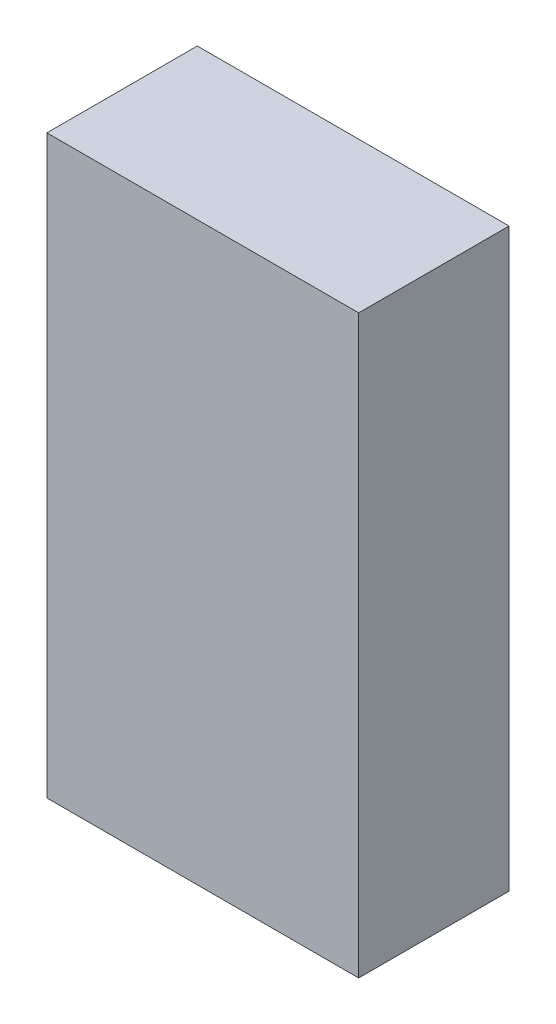
ISO-10303-21;
HEADER;
FILE_DESCRIPTION(('STEP AP214'),'2;1');
FILE_NAME('part.step','',(''),(''),'','','');
FILE_SCHEMA(('AUTOMOTIVE_DESIGN { 1 0 10303 214 1 1 1 1 }'));
ENDSEC;
DATA;
#1=APPLICATION_CONTEXT('core data for automotive mechanical design processes');
#2=APPLICATION_PROTOCOL_DEFINITION('international standard','automotive_design',2000,#1);
#3=PRODUCT_CONTEXT('',#1,'mechanical');
#4=PRODUCT('Part','Part','',(#3));
#5=PRODUCT_RELATED_PRODUCT_CATEGORY('part','',(#4));
#6=PRODUCT_DEFINITION_FORMATION('','',#4);
#7=PRODUCT_DEFINITION_CONTEXT('part definition',#1,'design');
#8=PRODUCT_DEFINITION('design','',#6,#7);
#9=PRODUCT_DEFINITION_SHAPE('','',#8);
#10=(LENGTH_UNIT() NAMED_UNIT(*) SI_UNIT(.MILLI.,.METRE.));
#11=(NAMED_UNIT(*) PLANE_ANGLE_UNIT() SI_UNIT($,.RADIAN.));
#12=(NAMED_UNIT(*) SI_UNIT($,.STERADIAN.) SOLID_ANGLE_UNIT());
#13=UNCERTAINTY_MEASURE_WITH_UNIT(LENGTH_MEASURE(1.E-05),#10,'distance_accuracy_value','');
#14=(GEOMETRIC_REPRESENTATION_CONTEXT(3) GLOBAL_UNCERTAINTY_ASSIGNED_CONTEXT((#13)) GLOBAL_UNIT_ASSIGNED_CONTEXT((#10,
#11,#12)) REPRESENTATION_CONTEXT('',''));
#15=CARTESIAN_POINT('',(0.,0.,0.));
#16=DIRECTION('',(0.,0.,1.));
#17=DIRECTION('',(1.,0.,0.));
#18=AXIS2_PLACEMENT_3D('',#15,#16,#17);
#19=CARTESIAN_POINT('',(0.,38.2926221353073,10.));
#20=DIRECTION('',(1.,0.,0.));
#21=DIRECTION('',(0.,0.,-1.));
#22=AXIS2_PLACEMENT_3D('',#19,#20,#21);
#23=PLANE('',#22);
#24=DIRECTION('',(0.,-1.,0.));
#25=VECTOR('',#24,1.);
#26=CARTESIAN_POINT('',(0.,38.2926221353073,0.));
#27=LINE('',#26,#25);
#28=CARTESIAN_POINT('',(0.,38.2926221353073,0.));
#29=VERTEX_POINT('',#28);
#30=CARTESIAN_POINT('',(0.,0.,0.));
#31=VERTEX_POINT('',#30);
#32=EDGE_CURVE('E113',#29,#31,#27,.T.);
#33=ORIENTED_EDGE('',*,*,#32,.T.);
#34=DIRECTION('',(0.,0.,-1.));
#35=VECTOR('',#34,1.);
#36=CARTESIAN_POINT('',(0.,0.,10.));
#37=LINE('',#36,#35);
#38=CARTESIAN_POINT('',(0.,0.,10.));
#39=VERTEX_POINT('',#38);
#40=EDGE_CURVE('E11',#39,#31,#37,.T.);
#41=ORIENTED_EDGE('',*,*,#40,.F.);
#42=DIRECTION('',(0.,-1.,0.));
#43=VECTOR('',#42,1.);
#44=CARTESIAN_POINT('',(0.,38.2926221353073,10.));
#45=LINE('',#44,#43);
#46=CARTESIAN_POINT('',(0.,38.2926221353073,10.));
#47=VERTEX_POINT('',#46);
#48=EDGE_CURVE('E97',#47,#39,#45,.T.);
#49=ORIENTED_EDGE('',*,*,#48,.F.);
#50=DIRECTION('',(0.,0.,-1.));
#51=VECTOR('',#50,1.);
#52=CARTESIAN_POINT('',(0.,38.2926221353073,10.));
#53=LINE('',#52,#51);
#54=EDGE_CURVE('E109',#47,#29,#53,.T.);
#55=ORIENTED_EDGE('',*,*,#54,.T.);
#56=EDGE_LOOP('',(#33,#41,#49,#55));
#57=FACE_BOUND('',#56,.T.);
#58=ADVANCED_FACE('F45',(#57),#23,.F.);
#59=CARTESIAN_POINT('',(0.,0.,10.));
#60=DIRECTION('',(0.,1.,0.));
#61=DIRECTION('',(0.,0.,1.));
#62=AXIS2_PLACEMENT_3D('',#59,#60,#61);
#63=PLANE('',#62);
#64=DIRECTION('',(1.,0.,0.));
#65=VECTOR('',#64,1.);
#66=CARTESIAN_POINT('',(0.,0.,0.));
#67=LINE('',#66,#65);
#68=CARTESIAN_POINT('',(20.7253689838188,0.,0.));
#69=VERTEX_POINT('',#68);
#70=EDGE_CURVE('E102',#31,#69,#67,.T.);
#71=ORIENTED_EDGE('',*,*,#70,.T.);
#72=DIRECTION('',(0.,0.,-1.));
#73=VECTOR('',#72,1.);
#74=CARTESIAN_POINT('',(20.7253689838188,0.,10.));
#75=LINE('',#74,#73);
#76=CARTESIAN_POINT('',(20.7253689838188,0.,10.));
#77=VERTEX_POINT('',#76);
#78=EDGE_CURVE('E54',#77,#69,#75,.T.);
#79=ORIENTED_EDGE('',*,*,#78,.F.);
#80=DIRECTION('',(1.,0.,0.));
#81=VECTOR('',#80,1.);
#82=CARTESIAN_POINT('',(0.,0.,10.));
#83=LINE('',#82,#81);
#84=EDGE_CURVE('E92',#39,#77,#83,.T.);
#85=ORIENTED_EDGE('',*,*,#84,.F.);
#86=ORIENTED_EDGE('',*,*,#40,.T.);
#87=EDGE_LOOP('',(#71,#79,#85,#86));
#88=FACE_BOUND('',#87,.T.);
#89=ADVANCED_FACE('F101',(#88),#63,.F.);
#90=CARTESIAN_POINT('',(20.7253689838188,0.,10.));
#91=DIRECTION('',(-1.,0.,0.));
#92=DIRECTION('',(0.,0.,1.));
#93=AXIS2_PLACEMENT_3D('',#90,#91,#92);
#94=PLANE('',#93);
#95=DIRECTION('',(0.,1.,0.));
#96=VECTOR('',#95,1.);
#97=CARTESIAN_POINT('',(20.7253689838188,0.,0.));
#98=LINE('',#97,#96);
#99=CARTESIAN_POINT('',(20.7253689838188,38.2926221353073,0.));
#100=VERTEX_POINT('',#99);
#101=EDGE_CURVE('E79',#69,#100,#98,.T.);
#102=ORIENTED_EDGE('',*,*,#101,.T.);
#103=DIRECTION('',(0.,0.,-1.));
#104=VECTOR('',#103,1.);
#105=CARTESIAN_POINT('',(20.7253689838188,38.2926221353073,10.));
#106=LINE('',#105,#104);
#107=CARTESIAN_POINT('',(20.7253689838188,38.2926221353073,10.));
#108=VERTEX_POINT('',#107);
#109=EDGE_CURVE('E104',#108,#100,#106,.T.);
#110=ORIENTED_EDGE('',*,*,#109,.F.);
#111=DIRECTION('',(0.,1.,0.));
#112=VECTOR('',#111,1.);
#113=CARTESIAN_POINT('',(20.7253689838188,0.,10.));
#114=LINE('',#113,#112);
#115=EDGE_CURVE('E95',#77,#108,#114,.T.);
#116=ORIENTED_EDGE('',*,*,#115,.F.);
#117=ORIENTED_EDGE('',*,*,#78,.T.);
#118=EDGE_LOOP('',(#102,#110,#116,#117));
#119=FACE_BOUND('',#118,.T.);
#120=ADVANCED_FACE('F105',(#119),#94,.F.);
#121=CARTESIAN_POINT('',(20.7253689838188,38.2926221353073,10.));
#122=DIRECTION('',(0.,-1.,0.));
#123=DIRECTION('',(0.,0.,-1.));
#124=AXIS2_PLACEMENT_3D('',#121,#122,#123);
#125=PLANE('',#124);
#126=DIRECTION('',(-1.,0.,0.));
#127=VECTOR('',#126,1.);
#128=CARTESIAN_POINT('',(20.7253689838188,38.2926221353073,0.));
#129=LINE('',#128,#127);
#130=EDGE_CURVE('E85',#100,#29,#129,.T.);
#131=ORIENTED_EDGE('',*,*,#130,.T.);
#132=ORIENTED_EDGE('',*,*,#54,.F.);
#133=DIRECTION('',(-1.,0.,0.));
#134=VECTOR('',#133,1.);
#135=CARTESIAN_POINT('',(20.7253689838188,38.2926221353073,10.));
#136=LINE('',#135,#134);
#137=EDGE_CURVE('E62',#108,#47,#136,.T.);
#138=ORIENTED_EDGE('',*,*,#137,.F.);
#139=ORIENTED_EDGE('',*,*,#109,.T.);
#140=EDGE_LOOP('',(#131,#132,#138,#139));
#141=FACE_BOUND('',#140,.T.);
#142=ADVANCED_FACE('F126',(#141),#125,.F.);
#143=CARTESIAN_POINT('',(0.,0.,10.));
#144=DIRECTION('',(0.,0.,1.));
#145=DIRECTION('',(1.,0.,0.));
#146=AXIS2_PLACEMENT_3D('',#143,#144,#145);
#147=PLANE('',#146);
#148=ORIENTED_EDGE('',*,*,#48,.T.);
#149=ORIENTED_EDGE('',*,*,#84,.T.);
#150=ORIENTED_EDGE('',*,*,#115,.T.);
#151=ORIENTED_EDGE('',*,*,#137,.T.);
#152=EDGE_LOOP('',(#148,#149,#150,#151));
#153=FACE_BOUND('',#152,.T.);
#154=ADVANCED_FACE('F93',(#153),#147,.T.);
#155=CARTESIAN_POINT('',(0.,0.,0.));
#156=DIRECTION('',(0.,0.,1.));
#157=DIRECTION('',(1.,0.,0.));
#158=AXIS2_PLACEMENT_3D('',#155,#156,#157);
#159=PLANE('',#158);
#160=ORIENTED_EDGE('',*,*,#32,.F.);
#161=ORIENTED_EDGE('',*,*,#130,.F.);
#162=ORIENTED_EDGE('',*,*,#101,.F.);
#163=ORIENTED_EDGE('',*,*,#70,.F.);
#164=EDGE_LOOP('',(#160,#161,#162,#163));
#165=FACE_BOUND('',#164,.T.);
#166=ADVANCED_FACE('F129',(#165),#159,.F.);
#167=CLOSED_SHELL('',(#58,#89,#120,#142,#154,#166));
#168=MANIFOLD_SOLID_BREP('B2',#167);
#169=ADVANCED_BREP_SHAPE_REPRESENTATION('',(#18,#168),#14);
#170=SHAPE_DEFINITION_REPRESENTATION(#9,#169);
ENDSEC;
END-ISO-10303-21;
